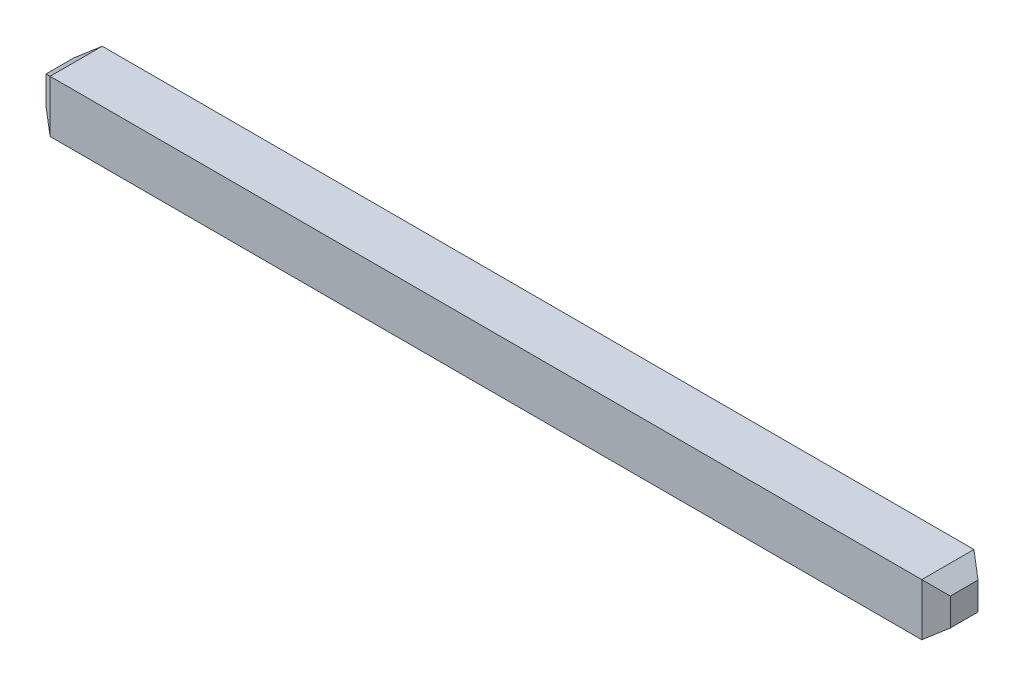
ISO-10303-21;
HEADER;
FILE_DESCRIPTION(('STEP AP214'),'2;1');
FILE_NAME('part.step','',(''),(''),'','','');
FILE_SCHEMA(('AUTOMOTIVE_DESIGN { 1 0 10303 214 1 1 1 1 }'));
ENDSEC;
DATA;
#1=APPLICATION_CONTEXT('core data for automotive mechanical design processes');
#2=APPLICATION_PROTOCOL_DEFINITION('international standard','automotive_design',2000,#1);
#3=PRODUCT_CONTEXT('',#1,'mechanical');
#4=PRODUCT('Part','Part','',(#3));
#5=PRODUCT_RELATED_PRODUCT_CATEGORY('part','',(#4));
#6=PRODUCT_DEFINITION_FORMATION('','',#4);
#7=PRODUCT_DEFINITION_CONTEXT('part definition',#1,'design');
#8=PRODUCT_DEFINITION('design','',#6,#7);
#9=PRODUCT_DEFINITION_SHAPE('','',#8);
#10=(LENGTH_UNIT() NAMED_UNIT(*) SI_UNIT(.MILLI.,.METRE.));
#11=(NAMED_UNIT(*) PLANE_ANGLE_UNIT() SI_UNIT($,.RADIAN.));
#12=(NAMED_UNIT(*) SI_UNIT($,.STERADIAN.) SOLID_ANGLE_UNIT());
#13=UNCERTAINTY_MEASURE_WITH_UNIT(LENGTH_MEASURE(1.E-05),#10,'distance_accuracy_value','');
#14=(GEOMETRIC_REPRESENTATION_CONTEXT(3) GLOBAL_UNCERTAINTY_ASSIGNED_CONTEXT((#13)) GLOBAL_UNIT_ASSIGNED_CONTEXT((#10,
#11,#12)) REPRESENTATION_CONTEXT('',''));
#15=CARTESIAN_POINT('',(0.,0.,0.));
#16=DIRECTION('',(0.,0.,1.));
#17=DIRECTION('',(1.,0.,0.));
#18=AXIS2_PLACEMENT_3D('',#15,#16,#17);
#19=CARTESIAN_POINT('',(-2.4,3.77,-42.155));
#20=DIRECTION('',(0.599999999990736,0.,0.800000000006948));
#21=DIRECTION('',(0.800000000006948,0.,-0.599999999990736));
#22=AXIS2_PLACEMENT_3D('',#19,#20,#21);
#23=PLANE('',#22);
#24=DIRECTION('',(0.,1.,0.));
#25=VECTOR('',#24,1.);
#26=CARTESIAN_POINT('',(-2.3,3.77,-42.23));
#27=LINE('',#26,#25);
#28=CARTESIAN_POINT('',(-2.29999999999957,4.09,-42.2299999999994));
#29=VERTEX_POINT('',#28);
#30=CARTESIAN_POINT('',(-2.29999999999957,3.45,-42.2299999999994));
#31=VERTEX_POINT('',#30);
#32=EDGE_CURVE('E101',#29,#31,#27,.F.);
#33=ORIENTED_EDGE('',*,*,#32,.T.);
#34=DIRECTION('',(-0.685994340570039,0.514495755427529,0.51449575542752));
#35=VECTOR('',#34,1.);
#36=CARTESIAN_POINT('',(-2.3,3.45,-42.23));
#37=LINE('',#36,#35);
#38=CARTESIAN_POINT('',(-2.50000000000022,3.6,-42.0800000000003));
#39=VERTEX_POINT('',#38);
#40=EDGE_CURVE('E85',#31,#39,#37,.T.);
#41=ORIENTED_EDGE('',*,*,#40,.T.);
#42=DIRECTION('',(0.,1.,0.));
#43=VECTOR('',#42,1.);
#44=CARTESIAN_POINT('',(-2.5,3.77,-42.08));
#45=LINE('',#44,#43);
#46=CARTESIAN_POINT('',(-2.50000000000044,3.94,-42.0800000000006));
#47=VERTEX_POINT('',#46);
#48=EDGE_CURVE('E79',#39,#47,#45,.T.);
#49=ORIENTED_EDGE('',*,*,#48,.T.);
#50=DIRECTION('',(-0.685994340570039,-0.514495755427529,0.51449575542752));
#51=VECTOR('',#50,1.);
#52=CARTESIAN_POINT('',(-2.3,4.09,-42.23));
#53=LINE('',#52,#51);
#54=EDGE_CURVE('E20',#29,#47,#53,.T.);
#55=ORIENTED_EDGE('',*,*,#54,.F.);
#56=EDGE_LOOP('',(#33,#41,#49,#55));
#57=FACE_BOUND('',#56,.T.);
#58=ADVANCED_FACE('F17',(#57),#23,.F.);
#59=CARTESIAN_POINT('',(8.5,3.77,-42.155));
#60=DIRECTION('',(-0.599999999990736,0.,0.800000000006948));
#61=DIRECTION('',(0.800000000006948,0.,0.599999999990736));
#62=AXIS2_PLACEMENT_3D('',#59,#60,#61);
#63=PLANE('',#62);
#64=DIRECTION('',(0.,1.,0.));
#65=VECTOR('',#64,1.);
#66=CARTESIAN_POINT('',(8.6,3.77,-42.08));
#67=LINE('',#66,#65);
#68=CARTESIAN_POINT('',(8.60000000000022,3.6,-42.0800000000003));
#69=VERTEX_POINT('',#68);
#70=CARTESIAN_POINT('',(8.60000000000044,3.94,-42.0800000000006));
#71=VERTEX_POINT('',#70);
#72=EDGE_CURVE('E113',#69,#71,#67,.T.);
#73=ORIENTED_EDGE('',*,*,#72,.F.);
#74=DIRECTION('',(-0.685994340570037,-0.514495755427528,-0.514495755427522));
#75=VECTOR('',#74,1.);
#76=CARTESIAN_POINT('',(8.6,3.6,-42.08));
#77=LINE('',#76,#75);
#78=CARTESIAN_POINT('',(8.39999999999957,3.45,-42.2299999999994));
#79=VERTEX_POINT('',#78);
#80=EDGE_CURVE('E108',#69,#79,#77,.T.);
#81=ORIENTED_EDGE('',*,*,#80,.T.);
#82=DIRECTION('',(0.,1.,0.));
#83=VECTOR('',#82,1.);
#84=CARTESIAN_POINT('',(8.4,3.77,-42.23));
#85=LINE('',#84,#83);
#86=CARTESIAN_POINT('',(8.39999999999957,4.09,-42.2299999999994));
#87=VERTEX_POINT('',#86);
#88=EDGE_CURVE('E99',#79,#87,#85,.T.);
#89=ORIENTED_EDGE('',*,*,#88,.T.);
#90=DIRECTION('',(-0.685994340570037,0.514495755427528,-0.514495755427522));
#91=VECTOR('',#90,1.);
#92=CARTESIAN_POINT('',(8.6,3.94,-42.08));
#93=LINE('',#92,#91);
#94=EDGE_CURVE('E116',#71,#87,#93,.T.);
#95=ORIENTED_EDGE('',*,*,#94,.F.);
#96=EDGE_LOOP('',(#73,#81,#89,#95));
#97=FACE_BOUND('',#96,.T.);
#98=ADVANCED_FACE('F214',(#97),#63,.F.);
#99=CARTESIAN_POINT('',(-2.4,4.015,-41.91));
#100=DIRECTION('',(-0.6,0.8,0.));
#101=DIRECTION('',(-0.8,-0.6,0.));
#102=AXIS2_PLACEMENT_3D('',#99,#100,#101);
#103=PLANE('',#102);
#104=DIRECTION('',(-0.685994340575995,-0.514495755427521,-0.514495755419586));
#105=VECTOR('',#104,1.);
#106=CARTESIAN_POINT('',(-2.29999999999913,4.09,-41.5900000000012));
#107=LINE('',#106,#105);
#108=CARTESIAN_POINT('',(-2.29999999999989,4.09,-41.5900000000001));
#109=VERTEX_POINT('',#108);
#110=CARTESIAN_POINT('',(-2.50000000000022,3.94,-41.7399999999997));
#111=VERTEX_POINT('',#110);
#112=EDGE_CURVE('E128',#109,#111,#107,.T.);
#113=ORIENTED_EDGE('',*,*,#112,.F.);
#114=DIRECTION('',(0.,0.,1.));
#115=VECTOR('',#114,1.);
#116=CARTESIAN_POINT('',(-2.3,4.09,-41.91));
#117=LINE('',#116,#115);
#118=EDGE_CURVE('E93',#29,#109,#117,.T.);
#119=ORIENTED_EDGE('',*,*,#118,.F.);
#120=ORIENTED_EDGE('',*,*,#54,.T.);
#121=DIRECTION('',(0.,0.,-1.));
#122=VECTOR('',#121,1.);
#123=CARTESIAN_POINT('',(-2.5,3.94,-41.91));
#124=LINE('',#123,#122);
#125=EDGE_CURVE('E87',#47,#111,#124,.F.);
#126=ORIENTED_EDGE('',*,*,#125,.T.);
#127=EDGE_LOOP('',(#113,#119,#120,#126));
#128=FACE_BOUND('',#127,.T.);
#129=ADVANCED_FACE('F90',(#128),#103,.T.);
#130=CARTESIAN_POINT('',(-2.5,3.77,-41.91));
#131=DIRECTION('',(1.,0.,0.));
#132=DIRECTION('',(0.,0.,-1.));
#133=AXIS2_PLACEMENT_3D('',#130,#131,#132);
#134=PLANE('',#133);
#135=DIRECTION('',(0.,1.,0.));
#136=VECTOR('',#135,1.);
#137=CARTESIAN_POINT('',(-2.50000000000087,3.77,-41.7399999999989));
#138=LINE('',#137,#136);
#139=CARTESIAN_POINT('',(-2.50000000000022,3.6,-41.7399999999997));
#140=VERTEX_POINT('',#139);
#141=EDGE_CURVE('E97',#111,#140,#138,.F.);
#142=ORIENTED_EDGE('',*,*,#141,.F.);
#143=ORIENTED_EDGE('',*,*,#125,.F.);
#144=ORIENTED_EDGE('',*,*,#48,.F.);
#145=DIRECTION('',(0.,0.,1.));
#146=VECTOR('',#145,1.);
#147=CARTESIAN_POINT('',(-2.5,3.6,-41.91));
#148=LINE('',#147,#146);
#149=EDGE_CURVE('E105',#39,#140,#148,.T.);
#150=ORIENTED_EDGE('',*,*,#149,.T.);
#151=EDGE_LOOP('',(#142,#143,#144,#150));
#152=FACE_BOUND('',#151,.T.);
#153=ADVANCED_FACE('F95',(#152),#134,.F.);
#154=CARTESIAN_POINT('',(3.05,3.77,-42.23));
#155=DIRECTION('',(0.,0.,1.));
#156=DIRECTION('',(1.,0.,0.));
#157=AXIS2_PLACEMENT_3D('',#154,#155,#156);
#158=PLANE('',#157);
#159=ORIENTED_EDGE('',*,*,#32,.F.);
#160=DIRECTION('',(1.,0.,0.));
#161=VECTOR('',#160,1.);
#162=CARTESIAN_POINT('',(3.05,4.09,-42.23));
#163=LINE('',#162,#161);
#164=EDGE_CURVE('E122',#87,#29,#163,.F.);
#165=ORIENTED_EDGE('',*,*,#164,.F.);
#166=ORIENTED_EDGE('',*,*,#88,.F.);
#167=DIRECTION('',(1.,0.,0.));
#168=VECTOR('',#167,1.);
#169=CARTESIAN_POINT('',(3.05,3.45,-42.23));
#170=LINE('',#169,#168);
#171=EDGE_CURVE('E136',#79,#31,#170,.F.);
#172=ORIENTED_EDGE('',*,*,#171,.T.);
#173=EDGE_LOOP('',(#159,#165,#166,#172));
#174=FACE_BOUND('',#173,.T.);
#175=ADVANCED_FACE('F182',(#174),#158,.F.);
#176=CARTESIAN_POINT('',(-2.4,3.525,-41.91));
#177=DIRECTION('',(0.6,0.8,0.));
#178=DIRECTION('',(-0.8,0.6,0.));
#179=AXIS2_PLACEMENT_3D('',#176,#177,#178);
#180=PLANE('',#179);
#181=DIRECTION('',(0.,0.,1.));
#182=VECTOR('',#181,1.);
#183=CARTESIAN_POINT('',(-2.3,3.45,-41.91));
#184=LINE('',#183,#182);
#185=CARTESIAN_POINT('',(-2.29999999999978,3.45,-41.5900000000003));
#186=VERTEX_POINT('',#185);
#187=EDGE_CURVE('E139',#31,#186,#184,.T.);
#188=ORIENTED_EDGE('',*,*,#187,.T.);
#189=DIRECTION('',(0.685994340575995,-0.514495755427521,0.514495755419586));
#190=VECTOR('',#189,1.);
#191=CARTESIAN_POINT('',(-2.50000000000087,3.6,-41.7399999999989));
#192=LINE('',#191,#190);
#193=EDGE_CURVE('E131',#140,#186,#192,.T.);
#194=ORIENTED_EDGE('',*,*,#193,.F.);
#195=ORIENTED_EDGE('',*,*,#149,.F.);
#196=ORIENTED_EDGE('',*,*,#40,.F.);
#197=EDGE_LOOP('',(#188,#194,#195,#196));
#198=FACE_BOUND('',#197,.T.);
#199=ADVANCED_FACE('F179',(#198),#180,.F.);
#200=CARTESIAN_POINT('',(8.5,3.525,-41.91));
#201=DIRECTION('',(-0.6,0.8,0.));
#202=DIRECTION('',(-0.8,-0.6,0.));
#203=AXIS2_PLACEMENT_3D('',#200,#201,#202);
#204=PLANE('',#203);
#205=DIRECTION('',(0.,0.,-1.));
#206=VECTOR('',#205,1.);
#207=CARTESIAN_POINT('',(8.6,3.6,-41.91));
#208=LINE('',#207,#206);
#209=CARTESIAN_POINT('',(8.60000000000022,3.6,-41.7399999999997));
#210=VERTEX_POINT('',#209);
#211=EDGE_CURVE('E110',#210,#69,#208,.T.);
#212=ORIENTED_EDGE('',*,*,#211,.F.);
#213=DIRECTION('',(0.685994340575993,0.514495755427522,-0.514495755419587));
#214=VECTOR('',#213,1.);
#215=CARTESIAN_POINT('',(8.39999999999913,3.45,-41.5900000000012));
#216=LINE('',#215,#214);
#217=CARTESIAN_POINT('',(8.39999999999989,3.45,-41.5900000000001));
#218=VERTEX_POINT('',#217);
#219=EDGE_CURVE('E35',#218,#210,#216,.T.);
#220=ORIENTED_EDGE('',*,*,#219,.F.);
#221=DIRECTION('',(0.,0.,1.));
#222=VECTOR('',#221,1.);
#223=CARTESIAN_POINT('',(8.4,3.45,-41.91));
#224=LINE('',#223,#222);
#225=EDGE_CURVE('E134',#218,#79,#224,.F.);
#226=ORIENTED_EDGE('',*,*,#225,.T.);
#227=ORIENTED_EDGE('',*,*,#80,.F.);
#228=EDGE_LOOP('',(#212,#220,#226,#227));
#229=FACE_BOUND('',#228,.T.);
#230=ADVANCED_FACE('F181',(#229),#204,.F.);
#231=CARTESIAN_POINT('',(8.6,3.77,-41.91));
#232=DIRECTION('',(1.,0.,0.));
#233=DIRECTION('',(0.,0.,-1.));
#234=AXIS2_PLACEMENT_3D('',#231,#232,#233);
#235=PLANE('',#234);
#236=ORIENTED_EDGE('',*,*,#72,.T.);
#237=DIRECTION('',(0.,0.,1.));
#238=VECTOR('',#237,1.);
#239=CARTESIAN_POINT('',(8.6,3.94,-41.91));
#240=LINE('',#239,#238);
#241=CARTESIAN_POINT('',(8.60000000000022,3.94,-41.7399999999997));
#242=VERTEX_POINT('',#241);
#243=EDGE_CURVE('E119',#242,#71,#240,.F.);
#244=ORIENTED_EDGE('',*,*,#243,.F.);
#245=DIRECTION('',(0.,1.,0.));
#246=VECTOR('',#245,1.);
#247=CARTESIAN_POINT('',(8.60000000000087,3.77,-41.7399999999989));
#248=LINE('',#247,#246);
#249=EDGE_CURVE('E142',#210,#242,#248,.T.);
#250=ORIENTED_EDGE('',*,*,#249,.F.);
#251=ORIENTED_EDGE('',*,*,#211,.T.);
#252=EDGE_LOOP('',(#236,#244,#250,#251));
#253=FACE_BOUND('',#252,.T.);
#254=ADVANCED_FACE('F189',(#253),#235,.T.);
#255=CARTESIAN_POINT('',(8.5,4.015,-41.91));
#256=DIRECTION('',(0.6,0.8,0.));
#257=DIRECTION('',(-0.8,0.6,0.));
#258=AXIS2_PLACEMENT_3D('',#255,#256,#257);
#259=PLANE('',#258);
#260=DIRECTION('',(-0.685994340575993,0.514495755427522,0.514495755419587));
#261=VECTOR('',#260,1.);
#262=CARTESIAN_POINT('',(8.60000000000087,3.94,-41.7399999999989));
#263=LINE('',#262,#261);
#264=CARTESIAN_POINT('',(8.39999999999989,4.09,-41.5900000000001));
#265=VERTEX_POINT('',#264);
#266=EDGE_CURVE('E145',#242,#265,#263,.T.);
#267=ORIENTED_EDGE('',*,*,#266,.F.);
#268=ORIENTED_EDGE('',*,*,#243,.T.);
#269=ORIENTED_EDGE('',*,*,#94,.T.);
#270=DIRECTION('',(0.,0.,1.));
#271=VECTOR('',#270,1.);
#272=CARTESIAN_POINT('',(8.4,4.09,-41.91));
#273=LINE('',#272,#271);
#274=EDGE_CURVE('E125',#265,#87,#273,.F.);
#275=ORIENTED_EDGE('',*,*,#274,.F.);
#276=EDGE_LOOP('',(#267,#268,#269,#275));
#277=FACE_BOUND('',#276,.T.);
#278=ADVANCED_FACE('F170',(#277),#259,.T.);
#279=CARTESIAN_POINT('',(3.05,4.09,-41.91));
#280=DIRECTION('',(0.,1.,0.));
#281=DIRECTION('',(0.,0.,1.));
#282=AXIS2_PLACEMENT_3D('',#279,#280,#281);
#283=PLANE('',#282);
#284=DIRECTION('',(1.,0.,0.));
#285=VECTOR('',#284,1.);
#286=CARTESIAN_POINT('',(3.05,4.09,-41.59));
#287=LINE('',#286,#285);
#288=EDGE_CURVE('E148',#265,#109,#287,.F.);
#289=ORIENTED_EDGE('',*,*,#288,.F.);
#290=ORIENTED_EDGE('',*,*,#274,.T.);
#291=ORIENTED_EDGE('',*,*,#164,.T.);
#292=ORIENTED_EDGE('',*,*,#118,.T.);
#293=EDGE_LOOP('',(#289,#290,#291,#292));
#294=FACE_BOUND('',#293,.T.);
#295=ADVANCED_FACE('F173',(#294),#283,.T.);
#296=CARTESIAN_POINT('',(-2.4,3.77,-41.665));
#297=DIRECTION('',(-0.599999999990736,0.,0.800000000006948));
#298=DIRECTION('',(0.800000000006948,0.,0.599999999990736));
#299=AXIS2_PLACEMENT_3D('',#296,#297,#298);
#300=PLANE('',#299);
#301=ORIENTED_EDGE('',*,*,#193,.T.);
#302=DIRECTION('',(0.,1.,0.));
#303=VECTOR('',#302,1.);
#304=CARTESIAN_POINT('',(-2.3,3.77,-41.59));
#305=LINE('',#304,#303);
#306=EDGE_CURVE('E151',#109,#186,#305,.F.);
#307=ORIENTED_EDGE('',*,*,#306,.F.);
#308=ORIENTED_EDGE('',*,*,#112,.T.);
#309=ORIENTED_EDGE('',*,*,#141,.T.);
#310=EDGE_LOOP('',(#301,#307,#308,#309));
#311=FACE_BOUND('',#310,.T.);
#312=ADVANCED_FACE('F176',(#311),#300,.T.);
#313=CARTESIAN_POINT('',(3.05,3.45,-41.91));
#314=DIRECTION('',(0.,1.,0.));
#315=DIRECTION('',(0.,0.,1.));
#316=AXIS2_PLACEMENT_3D('',#313,#314,#315);
#317=PLANE('',#316);
#318=ORIENTED_EDGE('',*,*,#187,.F.);
#319=ORIENTED_EDGE('',*,*,#171,.F.);
#320=ORIENTED_EDGE('',*,*,#225,.F.);
#321=DIRECTION('',(1.,0.,0.));
#322=VECTOR('',#321,1.);
#323=CARTESIAN_POINT('',(3.05,3.45,-41.59));
#324=LINE('',#323,#322);
#325=EDGE_CURVE('E26',#186,#218,#324,.T.);
#326=ORIENTED_EDGE('',*,*,#325,.F.);
#327=EDGE_LOOP('',(#318,#319,#320,#326));
#328=FACE_BOUND('',#327,.T.);
#329=ADVANCED_FACE('F162',(#328),#317,.F.);
#330=CARTESIAN_POINT('',(8.5,3.77,-41.665));
#331=DIRECTION('',(0.599999999990736,0.,0.800000000006948));
#332=DIRECTION('',(0.800000000006948,0.,-0.599999999990736));
#333=AXIS2_PLACEMENT_3D('',#330,#331,#332);
#334=PLANE('',#333);
#335=ORIENTED_EDGE('',*,*,#266,.T.);
#336=DIRECTION('',(0.,1.,0.));
#337=VECTOR('',#336,1.);
#338=CARTESIAN_POINT('',(8.4,3.77,-41.59));
#339=LINE('',#338,#337);
#340=EDGE_CURVE('E11',#218,#265,#339,.T.);
#341=ORIENTED_EDGE('',*,*,#340,.F.);
#342=ORIENTED_EDGE('',*,*,#219,.T.);
#343=ORIENTED_EDGE('',*,*,#249,.T.);
#344=EDGE_LOOP('',(#335,#341,#342,#343));
#345=FACE_BOUND('',#344,.T.);
#346=ADVANCED_FACE('F166',(#345),#334,.T.);
#347=CARTESIAN_POINT('',(3.05,3.77,-41.59));
#348=DIRECTION('',(0.,0.,1.));
#349=DIRECTION('',(1.,0.,0.));
#350=AXIS2_PLACEMENT_3D('',#347,#348,#349);
#351=PLANE('',#350);
#352=ORIENTED_EDGE('',*,*,#325,.T.);
#353=ORIENTED_EDGE('',*,*,#340,.T.);
#354=ORIENTED_EDGE('',*,*,#288,.T.);
#355=ORIENTED_EDGE('',*,*,#306,.T.);
#356=EDGE_LOOP('',(#352,#353,#354,#355));
#357=FACE_BOUND('',#356,.T.);
#358=ADVANCED_FACE('F157',(#357),#351,.T.);
#359=CLOSED_SHELL('',(#58,#98,#129,#153,#175,#199,#230,#254,#278,#295,#312,#329,#346,#358));
#360=MANIFOLD_SOLID_BREP('B1',#359);
#361=ADVANCED_BREP_SHAPE_REPRESENTATION('',(#18,#360),#14);
#362=SHAPE_DEFINITION_REPRESENTATION(#9,#361);
ENDSEC;
END-ISO-10303-21;
